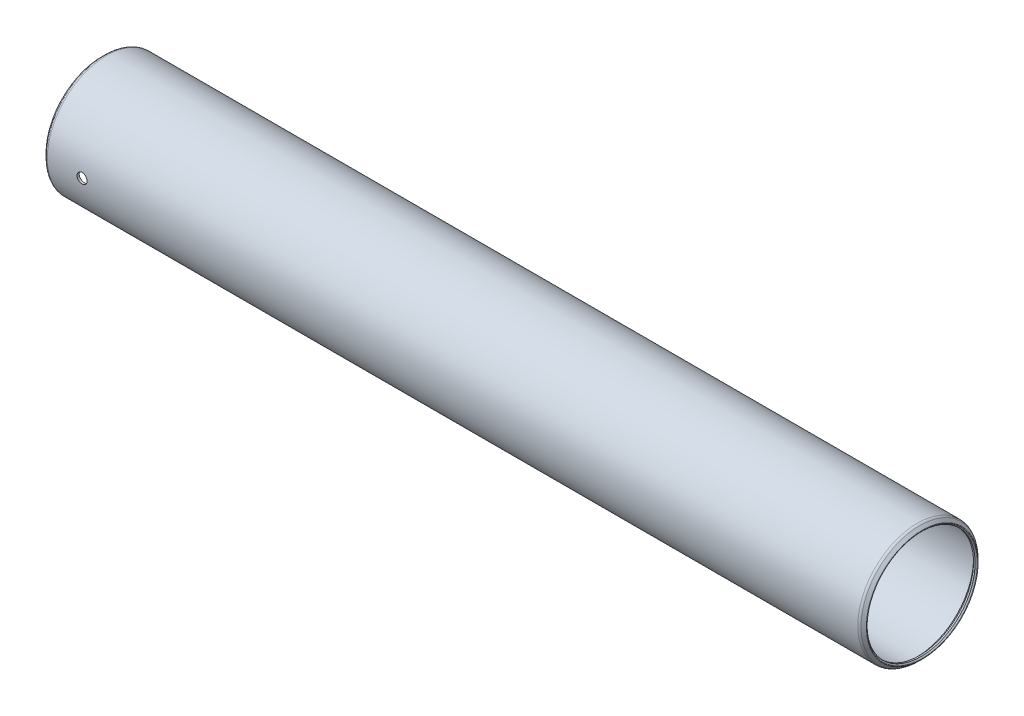
ISO-10303-21;
HEADER;
FILE_DESCRIPTION(('STEP AP214'),'2;1');
FILE_NAME('part.step','',(''),(''),'','','');
FILE_SCHEMA(('AUTOMOTIVE_DESIGN { 1 0 10303 214 1 1 1 1 }'));
ENDSEC;
DATA;
#1=APPLICATION_CONTEXT('core data for automotive mechanical design processes');
#2=APPLICATION_PROTOCOL_DEFINITION('international standard','automotive_design',2000,#1);
#3=PRODUCT_CONTEXT('',#1,'mechanical');
#4=PRODUCT('Part','Part','',(#3));
#5=PRODUCT_RELATED_PRODUCT_CATEGORY('part','',(#4));
#6=PRODUCT_DEFINITION_FORMATION('','',#4);
#7=PRODUCT_DEFINITION_CONTEXT('part definition',#1,'design');
#8=PRODUCT_DEFINITION('design','',#6,#7);
#9=PRODUCT_DEFINITION_SHAPE('','',#8);
#10=(LENGTH_UNIT() NAMED_UNIT(*) SI_UNIT(.MILLI.,.METRE.));
#11=(NAMED_UNIT(*) PLANE_ANGLE_UNIT() SI_UNIT($,.RADIAN.));
#12=(NAMED_UNIT(*) SI_UNIT($,.STERADIAN.) SOLID_ANGLE_UNIT());
#13=UNCERTAINTY_MEASURE_WITH_UNIT(LENGTH_MEASURE(1.E-05),#10,'distance_accuracy_value','');
#14=(GEOMETRIC_REPRESENTATION_CONTEXT(3) GLOBAL_UNCERTAINTY_ASSIGNED_CONTEXT((#13)) GLOBAL_UNIT_ASSIGNED_CONTEXT((#10,
#11,#12)) REPRESENTATION_CONTEXT('',''));
#15=CARTESIAN_POINT('',(0.,0.,0.));
#16=DIRECTION('',(0.,0.,1.));
#17=DIRECTION('',(1.,0.,0.));
#18=AXIS2_PLACEMENT_3D('',#15,#16,#17);
#19=CARTESIAN_POINT('',(193.5734,0.,0.));
#20=DIRECTION('',(-1.,0.,0.));
#21=DIRECTION('',(0.,0.,1.));
#22=AXIS2_PLACEMENT_3D('',#19,#20,#21);
#23=CYLINDRICAL_SURFACE('',#22,13.60805);
#24=CARTESIAN_POINT('',(0.762000000000013,0.,0.));
#25=DIRECTION('',(-1.,0.,0.));
#26=DIRECTION('',(0.,0.,1.));
#27=AXIS2_PLACEMENT_3D('',#24,#25,#26);
#28=CIRCLE('',#27,13.60805);
#29=CARTESIAN_POINT('',(0.762000000000013,0.,13.60805));
#30=VERTEX_POINT('',#29);
#31=EDGE_CURVE('E56',#30,#30,#28,.T.);
#32=ORIENTED_EDGE('',*,*,#31,.T.);
#33=EDGE_LOOP('',(#32));
#34=FACE_BOUND('',#33,.T.);
#35=CARTESIAN_POINT('',(192.8114,0.,0.));
#36=DIRECTION('',(-1.,0.,0.));
#37=DIRECTION('',(0.,0.,1.));
#38=AXIS2_PLACEMENT_3D('',#35,#36,#37);
#39=CIRCLE('',#38,13.60805);
#40=CARTESIAN_POINT('',(192.8114,0.,13.60805));
#41=VERTEX_POINT('',#40);
#42=EDGE_CURVE('E59',#41,#41,#39,.T.);
#43=ORIENTED_EDGE('',*,*,#42,.F.);
#44=EDGE_LOOP('',(#43));
#45=FACE_BOUND('',#44,.T.);
#46=CARTESIAN_POINT('',(9.95679999999999,0.,13.60805));
#47=CARTESIAN_POINT('',(9.95679708301893,-0.0669182546482718,13.608049316548));
#48=CARTESIAN_POINT('',(9.95115443233959,-0.133881741871162,13.6075511313661));
#49=CARTESIAN_POINT('',(9.92872838455429,-0.265955050546539,13.6056116722791));
#50=CARTESIAN_POINT('',(9.91193245128793,-0.331062700079983,13.6041693371863));
#51=CARTESIAN_POINT('',(9.8676900846028,-0.457492452892775,13.600504525612));
#52=CARTESIAN_POINT('',(9.84024977771192,-0.518816710269826,13.5982824979641));
#53=CARTESIAN_POINT('',(9.77550878988491,-0.635974564806711,13.5933073106333));
#54=CARTESIAN_POINT('',(9.73821018149235,-0.691809312663339,13.5905542626213));
#55=CARTESIAN_POINT('',(9.65469848449648,-0.7965743137312,13.5848171871262));
#56=CARTESIAN_POINT('',(9.60846341826353,-0.845487018835931,13.5818326012789));
#57=CARTESIAN_POINT('',(9.50843782103866,-0.934868846378991,13.5759734995207));
#58=CARTESIAN_POINT('',(9.4546469541021,-0.975337593184628,13.5730989885111));
#59=CARTESIAN_POINT('',(9.34092941918919,-1.04674292044388,13.5677795828556));
#60=CARTESIAN_POINT('',(9.280992951096,-1.07766395049416,13.565335391827));
#61=CARTESIAN_POINT('',(9.1567538010192,-1.12899678917914,13.5611599143374));
#62=CARTESIAN_POINT('',(9.09245120371227,-1.14940880155976,13.5594286140552));
#63=CARTESIAN_POINT('',(8.96148184852376,-1.17909296626753,13.5568797393416));
#64=CARTESIAN_POINT('',(8.8948216509038,-1.18839385737639,13.5560598080495));
#65=CARTESIAN_POINT('',(8.76088164230416,-1.19568055751461,13.5554190966986));
#66=CARTESIAN_POINT('',(8.69360184412538,-1.19366659978648,13.555598296044));
#67=CARTESIAN_POINT('',(8.56052969101664,-1.17840450616186,13.5569334538123));
#68=CARTESIAN_POINT('',(8.49473371875241,-1.16518763914177,13.5580866935214));
#69=CARTESIAN_POINT('',(8.36629761654667,-1.12794350298004,13.5612357313031));
#70=CARTESIAN_POINT('',(8.30365752035618,-1.10391611825092,13.5632315383846));
#71=CARTESIAN_POINT('',(8.18321185861607,-1.04569810788095,13.5678439633093));
#72=CARTESIAN_POINT('',(8.12541308946077,-1.0114934917358,13.5704614347403));
#73=CARTESIAN_POINT('',(8.01636511195066,-0.933902039337988,13.5760214947568));
#74=CARTESIAN_POINT('',(7.96511605083599,-0.890514996718806,13.5789640906484));
#75=CARTESIAN_POINT('',(7.87044047693493,-0.795615092475709,13.5848549435303));
#76=CARTESIAN_POINT('',(7.82704104819841,-0.744075205315693,13.5878031859359));
#77=CARTESIAN_POINT('',(7.74950622419902,-0.634426816025969,13.5933636651988));
#78=CARTESIAN_POINT('',(7.71537083604385,-0.576318308856631,13.5959759017984));
#79=CARTESIAN_POINT('',(7.65733461000234,-0.455164276524883,13.6005706231754));
#80=CARTESIAN_POINT('',(7.63343501463544,-0.392118153085045,13.6025530314905));
#81=CARTESIAN_POINT('',(7.5965679764888,-0.262886805098121,13.6056638839094));
#82=CARTESIAN_POINT('',(7.58360028224248,-0.19670165279513,13.6067923476564));
#83=CARTESIAN_POINT('',(7.56899920769066,-0.0633057084379337,13.6080656427365));
#84=CARTESIAN_POINT('',(7.5673284262197,0.00390096014763285,13.6082137198431));
#85=CARTESIAN_POINT('',(7.57527056376644,0.137638382320868,13.6075182347554));
#86=CARTESIAN_POINT('',(7.58488336595981,0.204169142899341,13.6066746828279));
#87=CARTESIAN_POINT('',(7.61508879198431,0.334559219682892,13.6040928727499));
#88=CARTESIAN_POINT('',(7.63566403643894,0.398422592305757,13.6023560309328));
#89=CARTESIAN_POINT('',(7.68719251361759,0.521790806302529,13.5981826863816));
#90=CARTESIAN_POINT('',(7.71814592753115,0.581295571558635,13.5957461714322));
#91=CARTESIAN_POINT('',(7.78964577513802,0.694427383789486,13.5904383750868));
#92=CARTESIAN_POINT('',(7.83021693615533,0.748038749909508,13.5875659800053));
#93=CARTESIAN_POINT('',(7.91976495742896,0.847703536830346,13.5817127326722));
#94=CARTESIAN_POINT('',(7.96874197958377,0.893756812027454,13.5787318783325));
#95=CARTESIAN_POINT('',(8.07387396535874,0.977126813007208,13.5729880250846));
#96=CARTESIAN_POINT('',(8.13004834977849,1.01441909752546,13.5702256495799));
#97=CARTESIAN_POINT('',(8.24788402429577,1.07904083433481,13.5652405289984));
#98=CARTESIAN_POINT('',(8.30954525454217,1.10637039528381,13.5630177780363));
#99=CARTESIAN_POINT('',(8.43651841293467,1.15024944112672,13.559367185593));
#100=CARTESIAN_POINT('',(8.50182517357792,1.1668137844106,13.5579382488695));
#101=CARTESIAN_POINT('',(8.63430609227215,1.18874053042524,13.5560334832072));
#102=CARTESIAN_POINT('',(8.70148021010278,1.19410317423634,13.5555576337563));
#103=CARTESIAN_POINT('',(8.83554611693338,1.19347137557144,13.5556132553957));
#104=CARTESIAN_POINT('',(8.90243809165198,1.18751533298986,13.5561413205969));
#105=CARTESIAN_POINT('',(9.03426766120116,1.1644954120055,13.5581380294439));
#106=CARTESIAN_POINT('',(9.09920525322321,1.14743151764102,13.5596066744412));
#107=CARTESIAN_POINT('',(9.22528451287958,1.10269022427221,13.5633181559878));
#108=CARTESIAN_POINT('',(9.2864264674737,1.07501362875311,13.5655609339264));
#109=CARTESIAN_POINT('',(9.40320259425023,1.00983676557016,13.5705680835019));
#110=CARTESIAN_POINT('',(9.45883683910169,0.972336627542543,13.5733324482555));
#111=CARTESIAN_POINT('',(9.56321493671497,0.888432807982477,13.5790824775698));
#112=CARTESIAN_POINT('',(9.61193584490628,0.842000630023597,13.5820688311231));
#113=CARTESIAN_POINT('',(9.70091338867967,0.741603984891418,13.5879200468851));
#114=CARTESIAN_POINT('',(9.74116797861839,0.6876377025462,13.5907848795984));
#115=CARTESIAN_POINT('',(9.81213036633629,0.573589955763267,13.5960759911951));
#116=CARTESIAN_POINT('',(9.84281871286696,0.513496357359421,13.5985013723954));
#117=CARTESIAN_POINT('',(9.89362986284665,0.389028363158872,13.6026300080547));
#118=CARTESIAN_POINT('',(9.91376475422052,0.324658960547063,13.6043340882591));
#119=CARTESIAN_POINT('',(9.93779579646115,0.216594595648881,13.6063929318442));
#120=CARTESIAN_POINT('',(9.94491283573995,0.17359363107121,13.6070114866693));
#121=CARTESIAN_POINT('',(9.95441587945564,0.0870681605825597,13.6078402424959));
#122=CARTESIAN_POINT('',(9.95680189807731,0.0435436562416746,13.6080504447217));
#123=CARTESIAN_POINT('',(9.95679999999999,0.,13.60805));
#124=B_SPLINE_CURVE_WITH_KNOTS('',3,(#46,#47,#48,#49,#50,#51,#52,#53,#54,#55,#56,#57,#58,#59,
#60,#61,#62,#63,#64,#65,#66,#67,#68,#69,#70,#71,#72,#73,#74,#75,#76,#77,#78,#79,#80,#81,#82,#83,
#84,#85,#86,#87,#88,#89,#90,#91,#92,#93,#94,#95,#96,#97,#98,#99,#100,#101,#102,#103,#104,#105,
#106,#107,#108,#109,#110,#111,#112,#113,#114,#115,#116,#117,#118,#119,#120,#121,#122,#123),
.UNSPECIFIED.,.T.,.F.,(4,2,2,2,2,2,2,2,2,2,2,2,2,2,2,2,2,2,2,2,2,2,2,2,2,2,2,2,2,2,2,2,2,2,2,2,
2,2,4),(0.,0.200595776364208,0.401417402555722,0.602123613959344,0.802787663743492,
1.00395163894922,1.20512456110373,1.40662342685356,1.60811838585192,1.80909104431727,
2.01005955997897,2.21046898470325,2.41088055228259,2.61156890595591,2.81226177039288,
3.01363441008906,3.21500720428504,3.41640443613274,3.61779703511228,3.81852254723748,
4.0192459811741,4.21965213971364,4.42006179727014,4.62099240769906,4.82192688852443,
5.02341544728019,5.22490180844603,5.42610947975998,5.62731282068517,5.82783477543159,
6.02835701832368,6.22886408271802,6.42936850125701,6.63052354054656,6.83172712749546,
7.03333719694748,7.23471583483494,7.36524374182047,7.49577125745047),.UNSPECIFIED.);
#125=CARTESIAN_POINT('',(9.95679999999999,0.,13.60805));
#126=VERTEX_POINT('',#125);
#127=EDGE_CURVE('E89',#126,#126,#124,.T.);
#128=ORIENTED_EDGE('',*,*,#127,.F.);
#129=EDGE_LOOP('',(#128));
#130=FACE_BOUND('',#129,.T.);
#131=ADVANCED_FACE('F32',(#34,#45,#130),#23,.F.);
#132=CARTESIAN_POINT('',(193.5734,0.,0.));
#133=DIRECTION('',(-1.,0.,0.));
#134=DIRECTION('',(0.,0.,1.));
#135=AXIS2_PLACEMENT_3D('',#132,#133,#134);
#136=CYLINDRICAL_SURFACE('',#135,14.1351000000001);
#137=CARTESIAN_POINT('',(0.527049999999973,0.,0.));
#138=DIRECTION('',(-1.,0.,0.));
#139=DIRECTION('',(0.,0.,1.));
#140=AXIS2_PLACEMENT_3D('',#137,#138,#139);
#141=CIRCLE('',#140,14.1351000000001);
#142=CARTESIAN_POINT('',(0.527049999999973,0.,14.1351000000001));
#143=VERTEX_POINT('',#142);
#144=EDGE_CURVE('E80',#143,#143,#141,.T.);
#145=ORIENTED_EDGE('',*,*,#144,.F.);
#146=EDGE_LOOP('',(#145));
#147=FACE_BOUND('',#146,.T.);
#148=CARTESIAN_POINT('',(193.04635,0.,0.));
#149=DIRECTION('',(-1.,0.,0.));
#150=DIRECTION('',(0.,0.,1.));
#151=AXIS2_PLACEMENT_3D('',#148,#149,#150);
#152=CIRCLE('',#151,14.1351);
#153=CARTESIAN_POINT('',(193.04635,0.,14.1351));
#154=VERTEX_POINT('',#153);
#155=EDGE_CURVE('E77',#154,#154,#152,.T.);
#156=ORIENTED_EDGE('',*,*,#155,.T.);
#157=EDGE_LOOP('',(#156));
#158=FACE_BOUND('',#157,.T.);
#159=CARTESIAN_POINT('',(7.5692,0.,14.1351000000001));
#160=CARTESIAN_POINT('',(7.56920292181596,-0.0669283271261537,14.1350993401613));
#161=CARTESIAN_POINT('',(7.57484726399437,-0.133902135301032,14.1346195848797));
#162=CARTESIAN_POINT('',(7.59728042319043,-0.265996491031899,14.1327518733434));
#163=CARTESIAN_POINT('',(7.6140818446467,-0.331114855572767,14.1313628899357));
#164=CARTESIAN_POINT('',(7.65833963765327,-0.457566086300831,14.1278336735271));
#165=CARTESIAN_POINT('',(7.68578995527623,-0.518901080423648,14.1256938674369));
#166=CARTESIAN_POINT('',(7.75055543839332,-0.636078307307289,14.1209029302644));
#167=CARTESIAN_POINT('',(7.78786850294063,-0.691921706407142,14.118251908113));
#168=CARTESIAN_POINT('',(7.87140556793543,-0.796691100327121,14.1127282376207));
#169=CARTESIAN_POINT('',(7.91765002219988,-0.845600761572881,14.1098550898243));
#170=CARTESIAN_POINT('',(8.01769391089028,-0.934974155924521,14.1042151767762));
#171=CARTESIAN_POINT('',(8.07149367808737,-0.975437516820742,14.1014484162172));
#172=CARTESIAN_POINT('',(8.18522013921747,-1.04682516542564,14.0963291859554));
#173=CARTESIAN_POINT('',(8.24515589291445,-1.07773506898988,14.0939773432358));
#174=CARTESIAN_POINT('',(8.36938985270397,-1.12904650202632,14.0899599818291));
#175=CARTESIAN_POINT('',(8.4336879798337,-1.14944822164851,14.0882944507232));
#176=CARTESIAN_POINT('',(8.56465764061446,-1.17911671021048,14.0858425083405));
#177=CARTESIAN_POINT('',(8.63132309864346,-1.18841012291819,14.0850539938178));
#178=CARTESIAN_POINT('',(8.76527196549843,-1.19568050509525,14.0844387230499));
#179=CARTESIAN_POINT('',(8.83255536241638,-1.19365769217976,14.0846119483101));
#180=CARTESIAN_POINT('',(8.96564752296844,-1.17837506017275,14.0858986730767));
#181=CARTESIAN_POINT('',(9.03145963928094,-1.1651442060237,14.0870097488695));
#182=CARTESIAN_POINT('',(9.15992568462764,-1.12786607104217,14.0900431828303));
#183=CARTESIAN_POINT('',(9.22257958207598,-1.10381868205565,14.0919655491104));
#184=CARTESIAN_POINT('',(9.34304293012354,-1.04555769253766,14.0964077496588));
#185=CARTESIAN_POINT('',(9.40084607074475,-1.01133110566503,14.0989283462982));
#186=CARTESIAN_POINT('',(9.50989807835045,-0.933692647803003,14.1042822979227));
#187=CARTESIAN_POINT('',(9.56114680890691,-0.890280585670664,14.1071156594156));
#188=CARTESIAN_POINT('',(9.65580364295232,-0.795341071971393,14.1127866730801));
#189=CARTESIAN_POINT('',(9.69918663747083,-0.743788581375684,14.1156243108149));
#190=CARTESIAN_POINT('',(9.77668634820717,-0.634118926305164,14.1209756782483));
#191=CARTESIAN_POINT('',(9.81080305801055,-0.576001757286086,14.1234894077226));
#192=CARTESIAN_POINT('',(9.86880022219154,-0.454836092003784,14.1279102278278));
#193=CARTESIAN_POINT('',(9.89267955450346,-0.391787056079347,14.129817251955));
#194=CARTESIAN_POINT('',(9.92950648637397,-0.262554923079166,14.1328090346271));
#195=CARTESIAN_POINT('',(9.94245431896717,-0.196371892844792,14.1338938107005));
#196=CARTESIAN_POINT('',(9.95701920600603,-0.0629680933603932,14.1351166222716));
#197=CARTESIAN_POINT('',(9.95867094036536,0.00424886415003703,14.1352575554141));
#198=CARTESIAN_POINT('',(9.95068760810625,0.138003690936403,14.1345845426697));
#199=CARTESIAN_POINT('',(9.94105264966805,0.204541566715009,14.133770605935));
#200=CARTESIAN_POINT('',(9.91079817844433,0.334950504129664,14.1312812487311));
#201=CARTESIAN_POINT('',(9.89019475037927,0.398825323483858,14.1296070898601));
#202=CARTESIAN_POINT('',(9.83860463060446,0.522211400617719,14.1255853425753));
#203=CARTESIAN_POINT('',(9.80761777042593,0.581722587579367,14.1232377432352));
#204=CARTESIAN_POINT('',(9.73605330986646,0.6948498536896,14.1181250228165));
#205=CARTESIAN_POINT('',(9.69545274639488,0.748451360742454,14.1153589078814));
#206=CARTESIAN_POINT('',(9.60584653631726,0.848090595113093,14.1097232324075));
#207=CARTESIAN_POINT('',(9.55684073971241,0.894128187417422,14.1068536700232));
#208=CARTESIAN_POINT('',(9.45166461794951,0.977451800981743,14.1013259313807));
#209=CARTESIAN_POINT('',(9.39547632423666,1.01471518341474,14.098668313394));
#210=CARTESIAN_POINT('',(9.27761957894872,1.07927735451325,14.0938733119401));
#211=CARTESIAN_POINT('',(9.21595118336847,1.10657624497985,14.0917359231582));
#212=CARTESIAN_POINT('',(9.08896477896685,1.15039599483741,14.0882265385031));
#213=CARTESIAN_POINT('',(9.02365157231614,1.16693068869567,14.0868535605164));
#214=CARTESIAN_POINT('',(8.89116384521411,1.18879771905824,14.0850251790498));
#215=CARTESIAN_POINT('',(8.82398936161352,1.19413027718917,14.0845697574168));
#216=CARTESIAN_POINT('',(8.68991090470376,1.1934390725901,14.0846283256226));
#217=CARTESIAN_POINT('',(8.62300674382314,1.1874508799686,14.0851392790866));
#218=CARTESIAN_POINT('',(8.4911579962589,1.16436235213308,14.0870665729208));
#219=CARTESIAN_POINT('',(8.42621341252206,1.14726200020965,14.0884829146524));
#220=CARTESIAN_POINT('',(8.30012520184655,1.10244363127395,14.0920605969998));
#221=CARTESIAN_POINT('',(8.23898133647736,1.07472628108087,14.0942218908268));
#222=CARTESIAN_POINT('',(8.12220888360784,1.00946467384947,14.0990460309781));
#223=CARTESIAN_POINT('',(8.06658021301955,0.971920564885075,14.1017088697448));
#224=CARTESIAN_POINT('',(7.962235186184,0.887937513679703,14.1072460196813));
#225=CARTESIAN_POINT('',(7.91354007085993,0.841472220861159,14.1101209413923));
#226=CARTESIAN_POINT('',(7.82462008071477,0.741013935895548,14.1157527492685));
#227=CARTESIAN_POINT('',(7.78439725693728,0.687019126185856,14.1185096067232));
#228=CARTESIAN_POINT('',(7.71350817019649,0.572927772140122,14.1235997666304));
#229=CARTESIAN_POINT('',(7.68286022000887,0.512819823292392,14.1259322539243));
#230=CARTESIAN_POINT('',(7.63213124684047,0.388332241258137,14.1299013567545));
#231=CARTESIAN_POINT('',(7.61203809165175,0.323957608729382,14.131538770825));
#232=CARTESIAN_POINT('',(7.58809979422027,0.216003457892249,14.1335134371225));
#233=CARTESIAN_POINT('',(7.58102180785904,0.173117960922013,14.1341056856219));
#234=CARTESIAN_POINT('',(7.57157096934717,0.0868280234485224,14.1348991805791));
#235=CARTESIAN_POINT('',(7.5691981043046,0.043423584367487,14.1351004281082));
#236=CARTESIAN_POINT('',(7.5692,0.,14.1351000000001));
#237=B_SPLINE_CURVE_WITH_KNOTS('',3,(#159,#160,#161,#162,#163,#164,#165,#166,#167,#168,#169,
#170,#171,#172,#173,#174,#175,#176,#177,#178,#179,#180,#181,#182,#183,#184,#185,#186,#187,#188,
#189,#190,#191,#192,#193,#194,#195,#196,#197,#198,#199,#200,#201,#202,#203,#204,#205,#206,#207,
#208,#209,#210,#211,#212,#213,#214,#215,#216,#217,#218,#219,#220,#221,#222,#223,#224,#225,#226,
#227,#228,#229,#230,#231,#232,#233,#234,#235,#236),.UNSPECIFIED.,.T.,.F.,(4,2,2,2,2,2,2,2,2,2,2,
2,2,2,2,2,2,2,2,2,2,2,2,2,2,2,2,2,2,2,2,2,2,2,2,2,2,2,4),(0.,0.200626436393935,
0.401479912090746,0.60221936896414,0.80291609904774,1.00407801556242,1.20524879496448,
1.40672100759489,1.60818957437337,1.80917393388867,2.01015442841468,2.21061710799124,
2.41108179202985,2.61180332856396,2.81252904237544,3.01388464415477,3.21524038531934,
3.41661819040051,3.61799170245818,3.81874670329254,4.01949977995424,4.21995926979817,
4.42042201220841,4.62136849367328,4.82231856157891,5.02378156560598,5.2252425113519,
5.42644401960252,5.62764154718096,5.82820795709324,6.02877466859883,6.22932878522544,
6.42987987998819,6.63103271998156,6.83223420091932,7.03381817408425,7.23516992672128,
7.36533817134602,7.49550605931189),.UNSPECIFIED.);
#238=CARTESIAN_POINT('',(7.5692,0.,14.1351000000001));
#239=VERTEX_POINT('',#238);
#240=EDGE_CURVE('E10',#239,#239,#237,.T.);
#241=ORIENTED_EDGE('',*,*,#240,.F.);
#242=EDGE_LOOP('',(#241));
#243=FACE_BOUND('',#242,.T.);
#244=ADVANCED_FACE('F110',(#147,#158,#243),#136,.T.);
#245=CARTESIAN_POINT('',(-0.549710244842028,0.,0.));
#246=DIRECTION('',(-1.,0.,0.));
#247=DIRECTION('',(0.,0.,1.));
#248=AXIS2_PLACEMENT_3D('',#245,#246,#247);
#249=TOROIDAL_SURFACE('',#248,13.194365367264,0.127000000000741);
#250=CARTESIAN_POINT('',(-0.639512806053455,0.,0.));
#251=DIRECTION('',(-1.,0.,0.));
#252=DIRECTION('',(0.,0.,1.));
#253=AXIS2_PLACEMENT_3D('',#250,#251,#252);
#254=CIRCLE('',#253,13.104562806053);
#255=CARTESIAN_POINT('',(-0.639512806053455,0.,13.104562806053));
#256=VERTEX_POINT('',#255);
#257=EDGE_CURVE('E43',#256,#256,#254,.T.);
#258=ORIENTED_EDGE('',*,*,#257,.F.);
#259=EDGE_LOOP('',(#258));
#260=FACE_BOUND('',#259,.T.);
#261=CARTESIAN_POINT('',(-0.639512806053455,0.,0.));
#262=DIRECTION('',(-1.,0.,0.));
#263=DIRECTION('',(0.,0.,1.));
#264=AXIS2_PLACEMENT_3D('',#261,#262,#263);
#265=CIRCLE('',#264,13.284167928475);
#266=CARTESIAN_POINT('',(-0.639512806053455,0.,13.284167928475));
#267=VERTEX_POINT('',#266);
#268=EDGE_CURVE('E86',#267,#267,#265,.T.);
#269=ORIENTED_EDGE('',*,*,#268,.T.);
#270=EDGE_LOOP('',(#269));
#271=FACE_BOUND('',#270,.T.);
#272=ADVANCED_FACE('F34',(#260,#271),#249,.T.);
#273=CARTESIAN_POINT('',(-0.639512806053455,0.,0.));
#274=DIRECTION('',(-1.,0.,0.));
#275=DIRECTION('',(0.,0.,1.));
#276=AXIS2_PLACEMENT_3D('',#273,#274,#275);
#277=CONICAL_SURFACE('',#276,13.104562806053,0.785398163396556);
#278=CARTESIAN_POINT('',(-0.380999999999992,0.,0.));
#279=DIRECTION('',(-1.,0.,0.));
#280=DIRECTION('',(0.,0.,1.));
#281=AXIS2_PLACEMENT_3D('',#278,#279,#280);
#282=CIRCLE('',#281,12.84605);
#283=CARTESIAN_POINT('',(-0.380999999999992,0.,12.84605));
#284=VERTEX_POINT('',#283);
#285=EDGE_CURVE('E47',#284,#284,#282,.T.);
#286=ORIENTED_EDGE('',*,*,#285,.F.);
#287=EDGE_LOOP('',(#286));
#288=FACE_BOUND('',#287,.T.);
#289=ORIENTED_EDGE('',*,*,#257,.T.);
#290=EDGE_LOOP('',(#289));
#291=FACE_BOUND('',#290,.T.);
#292=ADVANCED_FACE('F159',(#288,#291),#277,.F.);
#293=CARTESIAN_POINT('',(193.5734,0.,0.));
#294=DIRECTION('',(-1.,0.,0.));
#295=DIRECTION('',(0.,0.,1.));
#296=AXIS2_PLACEMENT_3D('',#293,#294,#295);
#297=CYLINDRICAL_SURFACE('',#296,12.84605);
#298=CARTESIAN_POINT('',(0.,0.,0.));
#299=DIRECTION('',(-1.,0.,0.));
#300=DIRECTION('',(0.,0.,1.));
#301=AXIS2_PLACEMENT_3D('',#298,#299,#300);
#302=CIRCLE('',#301,12.84605);
#303=CARTESIAN_POINT('',(0.,0.,12.84605));
#304=VERTEX_POINT('',#303);
#305=EDGE_CURVE('E51',#304,#304,#302,.T.);
#306=ORIENTED_EDGE('',*,*,#305,.F.);
#307=EDGE_LOOP('',(#306));
#308=FACE_BOUND('',#307,.T.);
#309=ORIENTED_EDGE('',*,*,#285,.T.);
#310=EDGE_LOOP('',(#309));
#311=FACE_BOUND('',#310,.T.);
#312=ADVANCED_FACE('F140',(#308,#311),#297,.F.);
#313=CARTESIAN_POINT('',(0.,0.,0.));
#314=DIRECTION('',(1.,0.,0.));
#315=DIRECTION('',(0.,0.,-1.));
#316=AXIS2_PLACEMENT_3D('',#313,#314,#315);
#317=CONICAL_SURFACE('',#316,12.84605,0.78539816339744);
#318=ORIENTED_EDGE('',*,*,#31,.F.);
#319=EDGE_LOOP('',(#318));
#320=FACE_BOUND('',#319,.T.);
#321=ORIENTED_EDGE('',*,*,#305,.T.);
#322=EDGE_LOOP('',(#321));
#323=FACE_BOUND('',#322,.T.);
#324=ADVANCED_FACE('F135',(#320,#323),#317,.F.);
#325=CARTESIAN_POINT('',(192.8114,0.,0.));
#326=DIRECTION('',(-1.,0.,0.));
#327=DIRECTION('',(0.,0.,1.));
#328=AXIS2_PLACEMENT_3D('',#325,#326,#327);
#329=CONICAL_SURFACE('',#328,13.60805,0.78539816339744);
#330=CARTESIAN_POINT('',(193.5734,0.,0.));
#331=DIRECTION('',(-1.,0.,0.));
#332=DIRECTION('',(0.,0.,1.));
#333=AXIS2_PLACEMENT_3D('',#330,#331,#332);
#334=CIRCLE('',#333,12.84605);
#335=CARTESIAN_POINT('',(193.5734,0.,12.84605));
#336=VERTEX_POINT('',#335);
#337=EDGE_CURVE('E62',#336,#336,#334,.T.);
#338=ORIENTED_EDGE('',*,*,#337,.F.);
#339=EDGE_LOOP('',(#338));
#340=FACE_BOUND('',#339,.T.);
#341=ORIENTED_EDGE('',*,*,#42,.T.);
#342=EDGE_LOOP('',(#341));
#343=FACE_BOUND('',#342,.T.);
#344=ADVANCED_FACE('F132',(#340,#343),#329,.F.);
#345=CARTESIAN_POINT('',(193.5734,0.,0.));
#346=DIRECTION('',(-1.,0.,0.));
#347=DIRECTION('',(0.,0.,1.));
#348=AXIS2_PLACEMENT_3D('',#345,#346,#347);
#349=CYLINDRICAL_SURFACE('',#348,12.84605);
#350=CARTESIAN_POINT('',(193.9544,0.,0.));
#351=DIRECTION('',(-1.,0.,0.));
#352=DIRECTION('',(0.,0.,1.));
#353=AXIS2_PLACEMENT_3D('',#350,#351,#352);
#354=CIRCLE('',#353,12.84605);
#355=CARTESIAN_POINT('',(193.9544,0.,12.84605));
#356=VERTEX_POINT('',#355);
#357=EDGE_CURVE('E65',#356,#356,#354,.T.);
#358=ORIENTED_EDGE('',*,*,#357,.F.);
#359=EDGE_LOOP('',(#358));
#360=FACE_BOUND('',#359,.T.);
#361=ORIENTED_EDGE('',*,*,#337,.T.);
#362=EDGE_LOOP('',(#361));
#363=FACE_BOUND('',#362,.T.);
#364=ADVANCED_FACE('F129',(#360,#363),#349,.F.);
#365=CARTESIAN_POINT('',(193.9544,0.,0.));
#366=DIRECTION('',(1.,0.,0.));
#367=DIRECTION('',(0.,0.,-1.));
#368=AXIS2_PLACEMENT_3D('',#365,#366,#367);
#369=CONICAL_SURFACE('',#368,12.84605,0.785398163397445);
#370=CARTESIAN_POINT('',(194.212912806053,0.,0.));
#371=DIRECTION('',(-1.,0.,0.));
#372=DIRECTION('',(0.,0.,1.));
#373=AXIS2_PLACEMENT_3D('',#370,#371,#372);
#374=CIRCLE('',#373,13.1045628060525);
#375=CARTESIAN_POINT('',(194.212912806053,0.,13.1045628060525));
#376=VERTEX_POINT('',#375);
#377=EDGE_CURVE('E68',#376,#376,#374,.T.);
#378=ORIENTED_EDGE('',*,*,#377,.F.);
#379=EDGE_LOOP('',(#378));
#380=FACE_BOUND('',#379,.T.);
#381=ORIENTED_EDGE('',*,*,#357,.T.);
#382=EDGE_LOOP('',(#381));
#383=FACE_BOUND('',#382,.T.);
#384=ADVANCED_FACE('F125',(#380,#383),#369,.F.);
#385=CARTESIAN_POINT('',(194.123110244842,0.,0.));
#386=DIRECTION('',(-1.,0.,0.));
#387=DIRECTION('',(0.,0.,1.));
#388=AXIS2_PLACEMENT_3D('',#385,#386,#387);
#389=TOROIDAL_SURFACE('',#388,13.1943653672621,0.126999999999123);
#390=CARTESIAN_POINT('',(194.212912806053,0.,0.));
#391=DIRECTION('',(-1.,0.,0.));
#392=DIRECTION('',(0.,0.,1.));
#393=AXIS2_PLACEMENT_3D('',#390,#391,#392);
#394=CIRCLE('',#393,13.2841679284716);
#395=CARTESIAN_POINT('',(194.212912806053,0.,13.2841679284716));
#396=VERTEX_POINT('',#395);
#397=EDGE_CURVE('E71',#396,#396,#394,.T.);
#398=ORIENTED_EDGE('',*,*,#397,.F.);
#399=EDGE_LOOP('',(#398));
#400=FACE_BOUND('',#399,.T.);
#401=ORIENTED_EDGE('',*,*,#377,.T.);
#402=EDGE_LOOP('',(#401));
#403=FACE_BOUND('',#402,.T.);
#404=ADVANCED_FACE('F121',(#400,#403),#389,.T.);
#405=CARTESIAN_POINT('',(194.212912806053,0.,0.));
#406=DIRECTION('',(-1.,0.,0.));
#407=DIRECTION('',(0.,0.,1.));
#408=AXIS2_PLACEMENT_3D('',#405,#406,#407);
#409=CONICAL_SURFACE('',#408,13.2841679284716,0.78539816339741);
#410=CARTESIAN_POINT('',(193.585165367256,0.,0.));
#411=DIRECTION('',(-1.,0.,0.));
#412=DIRECTION('',(0.,0.,1.));
#413=AXIS2_PLACEMENT_3D('',#410,#411,#412);
#414=CIRCLE('',#413,13.9119153672685);
#415=CARTESIAN_POINT('',(193.585165367256,0.,13.9119153672685));
#416=VERTEX_POINT('',#415);
#417=EDGE_CURVE('E74',#416,#416,#414,.T.);
#418=ORIENTED_EDGE('',*,*,#417,.F.);
#419=EDGE_LOOP('',(#418));
#420=FACE_BOUND('',#419,.T.);
#421=ORIENTED_EDGE('',*,*,#397,.T.);
#422=EDGE_LOOP('',(#421));
#423=FACE_BOUND('',#422,.T.);
#424=ADVANCED_FACE('F117',(#420,#423),#409,.T.);
#425=CARTESIAN_POINT('',(193.046350000002,0.,0.));
#426=DIRECTION('',(-1.,0.,0.));
#427=DIRECTION('',(0.,0.,1.));
#428=AXIS2_PLACEMENT_3D('',#425,#426,#427);
#429=TOROIDAL_SURFACE('',#428,13.3731000000143,0.761999999985763);
#430=ORIENTED_EDGE('',*,*,#155,.F.);
#431=EDGE_LOOP('',(#430));
#432=FACE_BOUND('',#431,.T.);
#433=ORIENTED_EDGE('',*,*,#417,.T.);
#434=EDGE_LOOP('',(#433));
#435=FACE_BOUND('',#434,.T.);
#436=ADVANCED_FACE('F108',(#432,#435),#429,.T.);
#437=CARTESIAN_POINT('',(0.527049999998018,0.,0.));
#438=DIRECTION('',(-1.,0.,0.));
#439=DIRECTION('',(0.,0.,1.));
#440=AXIS2_PLACEMENT_3D('',#437,#438,#439);
#441=TOROIDAL_SURFACE('',#440,13.3731000000051,0.761999999994964);
#442=CARTESIAN_POINT('',(-0.0117653672626339,0.,0.));
#443=DIRECTION('',(-1.,0.,0.));
#444=DIRECTION('',(0.,0.,1.));
#445=AXIS2_PLACEMENT_3D('',#442,#443,#444);
#446=CIRCLE('',#445,13.9119153672658);
#447=CARTESIAN_POINT('',(-0.0117653672626339,0.,13.9119153672658));
#448=VERTEX_POINT('',#447);
#449=EDGE_CURVE('E83',#448,#448,#446,.T.);
#450=ORIENTED_EDGE('',*,*,#449,.F.);
#451=EDGE_LOOP('',(#450));
#452=FACE_BOUND('',#451,.T.);
#453=ORIENTED_EDGE('',*,*,#144,.T.);
#454=EDGE_LOOP('',(#453));
#455=FACE_BOUND('',#454,.T.);
#456=ADVANCED_FACE('F105',(#452,#455),#441,.T.);
#457=CARTESIAN_POINT('',(-0.0117653672626339,0.,0.));
#458=DIRECTION('',(1.,0.,0.));
#459=DIRECTION('',(0.,0.,-1.));
#460=AXIS2_PLACEMENT_3D('',#457,#458,#459);
#461=CONICAL_SURFACE('',#460,13.9119153672658,0.785398163397442);
#462=ORIENTED_EDGE('',*,*,#268,.F.);
#463=EDGE_LOOP('',(#462));
#464=FACE_BOUND('',#463,.T.);
#465=ORIENTED_EDGE('',*,*,#449,.T.);
#466=EDGE_LOOP('',(#465));
#467=FACE_BOUND('',#466,.T.);
#468=ADVANCED_FACE('F101',(#464,#467),#461,.T.);
#469=CARTESIAN_POINT('',(8.763,0.,14.1351));
#470=DIRECTION('',(0.,0.,-1.));
#471=DIRECTION('',(-1.,0.,0.));
#472=AXIS2_PLACEMENT_3D('',#469,#470,#471);
#473=CYLINDRICAL_SURFACE('',#472,1.1938);
#474=ORIENTED_EDGE('',*,*,#240,.T.);
#475=EDGE_LOOP('',(#474));
#476=FACE_BOUND('',#475,.T.);
#477=ORIENTED_EDGE('',*,*,#127,.T.);
#478=EDGE_LOOP('',(#477));
#479=FACE_BOUND('',#478,.T.);
#480=ADVANCED_FACE('F97',(#476,#479),#473,.F.);
#481=CLOSED_SHELL('',(#131,#244,#272,#292,#312,#324,#344,#364,#384,#404,#424,#436,#456,#468,#480));
#482=MANIFOLD_SOLID_BREP('B2',#481);
#483=ADVANCED_BREP_SHAPE_REPRESENTATION('',(#18,#482),#14);
#484=SHAPE_DEFINITION_REPRESENTATION(#9,#483);
ENDSEC;
END-ISO-10303-21;
